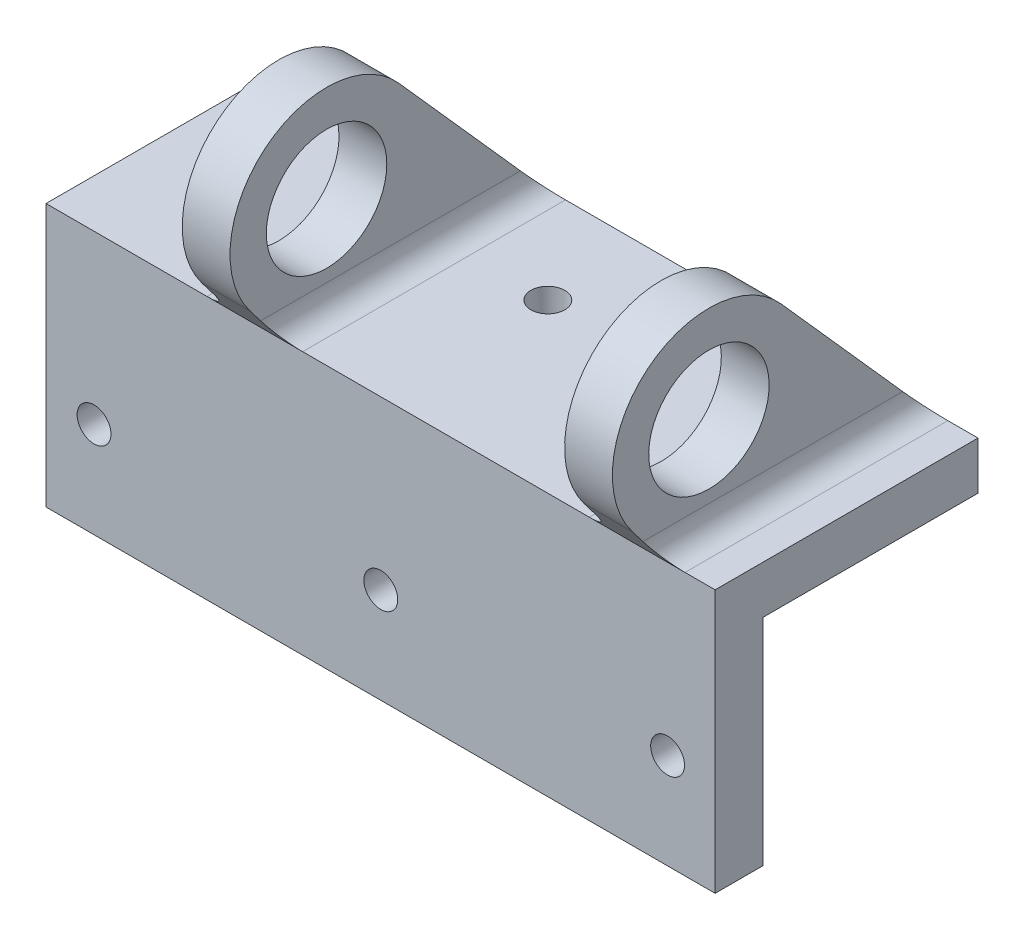
ISO-10303-21;
HEADER;
FILE_DESCRIPTION(('STEP AP214'),'2;1');
FILE_NAME('part.step','',(''),(''),'','','');
FILE_SCHEMA(('AUTOMOTIVE_DESIGN { 1 0 10303 214 1 1 1 1 }'));
ENDSEC;
DATA;
#1=APPLICATION_CONTEXT('core data for automotive mechanical design processes');
#2=APPLICATION_PROTOCOL_DEFINITION('international standard','automotive_design',2000,#1);
#3=PRODUCT_CONTEXT('',#1,'mechanical');
#4=PRODUCT('Part','Part','',(#3));
#5=PRODUCT_RELATED_PRODUCT_CATEGORY('part','',(#4));
#6=PRODUCT_DEFINITION_FORMATION('','',#4);
#7=PRODUCT_DEFINITION_CONTEXT('part definition',#1,'design');
#8=PRODUCT_DEFINITION('design','',#6,#7);
#9=PRODUCT_DEFINITION_SHAPE('','',#8);
#10=(LENGTH_UNIT() NAMED_UNIT(*) SI_UNIT(.MILLI.,.METRE.));
#11=(NAMED_UNIT(*) PLANE_ANGLE_UNIT() SI_UNIT($,.RADIAN.));
#12=(NAMED_UNIT(*) SI_UNIT($,.STERADIAN.) SOLID_ANGLE_UNIT());
#13=UNCERTAINTY_MEASURE_WITH_UNIT(LENGTH_MEASURE(1.E-05),#10,'distance_accuracy_value','');
#14=(GEOMETRIC_REPRESENTATION_CONTEXT(3) GLOBAL_UNCERTAINTY_ASSIGNED_CONTEXT((#13)) GLOBAL_UNIT_ASSIGNED_CONTEXT((#10,
#11,#12)) REPRESENTATION_CONTEXT('',''));
#15=CARTESIAN_POINT('',(0.,0.,0.));
#16=DIRECTION('',(0.,0.,1.));
#17=DIRECTION('',(1.,0.,0.));
#18=AXIS2_PLACEMENT_3D('',#15,#16,#17);
#19=CARTESIAN_POINT('',(0.,20.6375,0.));
#20=DIRECTION('',(0.,1.,0.));
#21=DIRECTION('',(-1.,0.,0.));
#22=AXIS2_PLACEMENT_3D('',#19,#20,#21);
#23=PLANE('',#22);
#24=CARTESIAN_POINT('',(0.,20.6375,-15.875));
#25=DIRECTION('',(0.,1.,0.));
#26=DIRECTION('',(-1.,0.,0.));
#27=AXIS2_PLACEMENT_3D('',#24,#25,#26);
#28=CIRCLE('',#27,2.25);
#29=CARTESIAN_POINT('',(-2.25,20.6375,-15.875));
#30=VERTEX_POINT('',#29);
#31=EDGE_CURVE('E269',#30,#30,#28,.T.);
#32=ORIENTED_EDGE('',*,*,#31,.F.);
#33=EDGE_LOOP('',(#32));
#34=FACE_BOUND('',#33,.T.);
#35=DIRECTION('',(1.,0.,0.));
#36=VECTOR('',#35,1.);
#37=CARTESIAN_POINT('',(0.,20.6375,6.35));
#38=LINE('',#37,#36);
#39=CARTESIAN_POINT('',(-10.35,20.6375,6.35));
#40=VERTEX_POINT('',#39);
#41=CARTESIAN_POINT('',(27.75,20.6375,6.35));
#42=VERTEX_POINT('',#41);
#43=EDGE_CURVE('E259',#40,#42,#38,.T.);
#44=ORIENTED_EDGE('',*,*,#43,.T.);
#45=DIRECTION('',(0.,0.,-1.));
#46=VECTOR('',#45,1.);
#47=CARTESIAN_POINT('',(27.75,20.6375,0.));
#48=LINE('',#47,#46);
#49=CARTESIAN_POINT('',(27.75,20.6375,-28.575));
#50=VERTEX_POINT('',#49);
#51=EDGE_CURVE('E341',#42,#50,#48,.T.);
#52=ORIENTED_EDGE('',*,*,#51,.T.);
#53=DIRECTION('',(1.,0.,0.));
#54=VECTOR('',#53,1.);
#55=CARTESIAN_POINT('',(0.,20.6375,-28.575));
#56=LINE('',#55,#54);
#57=CARTESIAN_POINT('',(-10.35,20.6375,-28.575));
#58=VERTEX_POINT('',#57);
#59=EDGE_CURVE('E266',#58,#50,#56,.T.);
#60=ORIENTED_EDGE('',*,*,#59,.F.);
#61=DIRECTION('',(0.,0.,-1.));
#62=VECTOR('',#61,1.);
#63=CARTESIAN_POINT('',(-10.35,20.6375,6.35));
#64=LINE('',#63,#62);
#65=EDGE_CURVE('E338',#58,#40,#64,.F.);
#66=ORIENTED_EDGE('',*,*,#65,.T.);
#67=EDGE_LOOP('',(#44,#52,#60,#66));
#68=FACE_BOUND('',#67,.T.);
#69=ADVANCED_FACE('F60',(#34,#68),#23,.T.);
#70=CARTESIAN_POINT('',(0.,20.6375,-28.575));
#71=DIRECTION('',(0.,0.,-1.));
#72=DIRECTION('',(-1.,0.,0.));
#73=AXIS2_PLACEMENT_3D('',#70,#71,#72);
#74=PLANE('',#73);
#75=CARTESIAN_POINT('',(-44.45,20.6375,-28.575));
#76=VERTEX_POINT('',#75);
#77=CARTESIAN_POINT('',(-23.05,20.6375,-28.575));
#78=VERTEX_POINT('',#77);
#79=EDGE_CURVE('E263',#76,#78,#56,.T.);
#80=ORIENTED_EDGE('',*,*,#79,.T.);
#81=DIRECTION('',(-1.,0.,0.));
#82=VECTOR('',#81,1.);
#83=CARTESIAN_POINT('',(77.153,20.6375,-28.575));
#84=LINE('',#83,#82);
#85=EDGE_CURVE('E76',#58,#78,#84,.T.);
#86=ORIENTED_EDGE('',*,*,#85,.F.);
#87=ORIENTED_EDGE('',*,*,#59,.T.);
#88=CARTESIAN_POINT('',(40.45,20.6375,-28.575));
#89=VERTEX_POINT('',#88);
#90=EDGE_CURVE('E216',#89,#50,#84,.T.);
#91=ORIENTED_EDGE('',*,*,#90,.F.);
#92=CARTESIAN_POINT('',(44.45,20.6375,-28.575));
#93=VERTEX_POINT('',#92);
#94=EDGE_CURVE('E262',#89,#93,#56,.T.);
#95=ORIENTED_EDGE('',*,*,#94,.T.);
#96=DIRECTION('',(0.,-1.,0.));
#97=VECTOR('',#96,1.);
#98=CARTESIAN_POINT('',(44.45,20.6375,-28.575));
#99=LINE('',#98,#97);
#100=CARTESIAN_POINT('',(44.45,14.2875,-28.575));
#101=VERTEX_POINT('',#100);
#102=EDGE_CURVE('E286',#93,#101,#99,.T.);
#103=ORIENTED_EDGE('',*,*,#102,.T.);
#104=DIRECTION('',(1.,0.,0.));
#105=VECTOR('',#104,1.);
#106=CARTESIAN_POINT('',(0.,14.2875,-28.575));
#107=LINE('',#106,#105);
#108=CARTESIAN_POINT('',(-44.45,14.2875,-28.575));
#109=VERTEX_POINT('',#108);
#110=EDGE_CURVE('E278',#109,#101,#107,.T.);
#111=ORIENTED_EDGE('',*,*,#110,.F.);
#112=DIRECTION('',(0.,-1.,0.));
#113=VECTOR('',#112,1.);
#114=CARTESIAN_POINT('',(-44.45,20.6375,-28.575));
#115=LINE('',#114,#113);
#116=EDGE_CURVE('E272',#76,#109,#115,.T.);
#117=ORIENTED_EDGE('',*,*,#116,.F.);
#118=EDGE_LOOP('',(#80,#86,#87,#91,#95,#103,#111,#117));
#119=FACE_BOUND('',#118,.T.);
#120=ADVANCED_FACE('F398',(#119),#74,.T.);
#121=CARTESIAN_POINT('',(-19.875,52.3875,0.));
#122=DIRECTION('',(1.,0.,0.));
#123=DIRECTION('',(0.,1.,0.));
#124=AXIS2_PLACEMENT_3D('',#121,#122,#123);
#125=PLANE('',#124);
#126=CARTESIAN_POINT('',(-19.875,33.4625,0.));
#127=DIRECTION('',(-1.,0.,0.));
#128=DIRECTION('',(0.,-1.,0.));
#129=AXIS2_PLACEMENT_3D('',#126,#127,#128);
#130=CIRCLE('',#129,8.);
#131=CARTESIAN_POINT('',(-19.875,25.4625,0.));
#132=VERTEX_POINT('',#131);
#133=EDGE_CURVE('E229',#132,#132,#130,.T.);
#134=ORIENTED_EDGE('',*,*,#133,.F.);
#135=EDGE_LOOP('',(#134));
#136=FACE_BOUND('',#135,.T.);
#137=DIRECTION('',(0.,-0.747135927340283,-0.664671276705542));
#138=VECTOR('',#137,1.);
#139=CARTESIAN_POINT('',(-19.875,23.3077369308627,-26.1994887643658));
#140=LINE('',#139,#138);
#141=CARTESIAN_POINT('',(-19.875,41.9869091237486,-9.58201826813913));
#142=VERTEX_POINT('',#141);
#143=CARTESIAN_POINT('',(-19.875,23.8125,-25.7504385964912));
#144=VERTEX_POINT('',#143);
#145=EDGE_CURVE('E191',#142,#144,#140,.T.);
#146=ORIENTED_EDGE('',*,*,#145,.T.);
#147=DIRECTION('',(0.,0.,-1.));
#148=VECTOR('',#147,1.);
#149=CARTESIAN_POINT('',(-19.875,23.8125,0.));
#150=LINE('',#149,#148);
#151=CARTESIAN_POINT('',(-19.875,23.8125,8.77023635477583));
#152=VERTEX_POINT('',#151);
#153=EDGE_CURVE('E348',#144,#152,#150,.F.);
#154=ORIENTED_EDGE('',*,*,#153,.T.);
#155=DIRECTION('',(0.,0.795288157834506,0.606231594366541));
#156=VECTOR('',#155,1.);
#157=CARTESIAN_POINT('',(-19.875,4.52310891554845,-5.93366461028824));
#158=LINE('',#157,#156);
#159=CARTESIAN_POINT('',(-19.875,25.6875798022491,10.1995706242275));
#160=VERTEX_POINT('',#159);
#161=EDGE_CURVE('E236',#152,#160,#158,.T.);
#162=ORIENTED_EDGE('',*,*,#161,.T.);
#163=CARTESIAN_POINT('',(-19.875,33.4625,0.));
#164=DIRECTION('',(-1.,0.,0.));
#165=DIRECTION('',(0.,-1.,0.));
#166=AXIS2_PLACEMENT_3D('',#163,#164,#165);
#167=CIRCLE('',#166,12.825);
#168=EDGE_CURVE('E233',#160,#142,#167,.T.);
#169=ORIENTED_EDGE('',*,*,#168,.T.);
#170=EDGE_LOOP('',(#146,#154,#162,#169));
#171=FACE_BOUND('',#170,.T.);
#172=ADVANCED_FACE('F429',(#136,#171),#125,.F.);
#173=CARTESIAN_POINT('',(-13.525,52.3875,0.));
#174=DIRECTION('',(1.,0.,0.));
#175=DIRECTION('',(0.,1.,0.));
#176=AXIS2_PLACEMENT_3D('',#173,#174,#175);
#177=PLANE('',#176);
#178=CARTESIAN_POINT('',(-13.525,33.4625,0.));
#179=DIRECTION('',(1.,0.,0.));
#180=DIRECTION('',(0.,1.,0.));
#181=AXIS2_PLACEMENT_3D('',#178,#179,#180);
#182=CIRCLE('',#181,8.);
#183=CARTESIAN_POINT('',(-13.525,41.4625,0.));
#184=VERTEX_POINT('',#183);
#185=EDGE_CURVE('E235',#184,#184,#182,.F.);
#186=ORIENTED_EDGE('',*,*,#185,.T.);
#187=EDGE_LOOP('',(#186));
#188=FACE_BOUND('',#187,.T.);
#189=DIRECTION('',(0.,0.795288157834506,0.606231594366541));
#190=VECTOR('',#189,1.);
#191=CARTESIAN_POINT('',(-13.525,4.52310891554845,-5.93366461028824));
#192=LINE('',#191,#190);
#193=CARTESIAN_POINT('',(-13.525,23.8125,8.77023635477583));
#194=VERTEX_POINT('',#193);
#195=CARTESIAN_POINT('',(-13.525,25.6875798022491,10.1995706242275));
#196=VERTEX_POINT('',#195);
#197=EDGE_CURVE('E239',#194,#196,#192,.T.);
#198=ORIENTED_EDGE('',*,*,#197,.F.);
#199=DIRECTION('',(0.,0.,-1.));
#200=VECTOR('',#199,1.);
#201=CARTESIAN_POINT('',(-13.525,23.8125,-28.575));
#202=LINE('',#201,#200);
#203=CARTESIAN_POINT('',(-13.525,23.8125,-25.7504385964912));
#204=VERTEX_POINT('',#203);
#205=EDGE_CURVE('E350',#194,#204,#202,.T.);
#206=ORIENTED_EDGE('',*,*,#205,.T.);
#207=DIRECTION('',(0.,0.747135927340283,0.664671276705542));
#208=VECTOR('',#207,1.);
#209=CARTESIAN_POINT('',(-13.525,52.5510730012343,-0.18386722918243));
#210=LINE('',#209,#208);
#211=CARTESIAN_POINT('',(-13.525,41.9869091237486,-9.58201826813913));
#212=VERTEX_POINT('',#211);
#213=EDGE_CURVE('E227',#204,#212,#210,.T.);
#214=ORIENTED_EDGE('',*,*,#213,.T.);
#215=CARTESIAN_POINT('',(-13.525,33.4625,0.));
#216=DIRECTION('',(1.,0.,0.));
#217=DIRECTION('',(0.,1.,0.));
#218=AXIS2_PLACEMENT_3D('',#215,#216,#217);
#219=CIRCLE('',#218,12.825);
#220=EDGE_CURVE('E232',#196,#212,#219,.F.);
#221=ORIENTED_EDGE('',*,*,#220,.F.);
#222=EDGE_LOOP('',(#198,#206,#214,#221));
#223=FACE_BOUND('',#222,.T.);
#224=ADVANCED_FACE('F488',(#188,#223),#177,.T.);
#225=CARTESIAN_POINT('',(37.275,52.3875,0.));
#226=DIRECTION('',(1.,0.,0.));
#227=DIRECTION('',(0.,1.,0.));
#228=AXIS2_PLACEMENT_3D('',#225,#226,#227);
#229=PLANE('',#228);
#230=CARTESIAN_POINT('',(37.275,33.4625,0.));
#231=DIRECTION('',(1.,0.,0.));
#232=DIRECTION('',(0.,1.,0.));
#233=AXIS2_PLACEMENT_3D('',#230,#231,#232);
#234=CIRCLE('',#233,8.);
#235=CARTESIAN_POINT('',(37.275,25.4625,0.));
#236=VERTEX_POINT('',#235);
#237=EDGE_CURVE('E222',#236,#236,#234,.T.);
#238=ORIENTED_EDGE('',*,*,#237,.F.);
#239=EDGE_LOOP('',(#238));
#240=FACE_BOUND('',#239,.T.);
#241=DIRECTION('',(0.,-0.795288157834505,-0.606231594366542));
#242=VECTOR('',#241,1.);
#243=CARTESIAN_POINT('',(37.275,4.52310891554847,-5.93366461028824));
#244=LINE('',#243,#242);
#245=CARTESIAN_POINT('',(37.275,25.6875798022491,10.1995706242275));
#246=VERTEX_POINT('',#245);
#247=CARTESIAN_POINT('',(37.275,23.8125,8.77023635477584));
#248=VERTEX_POINT('',#247);
#249=EDGE_CURVE('E192',#246,#248,#244,.T.);
#250=ORIENTED_EDGE('',*,*,#249,.T.);
#251=DIRECTION('',(0.,0.,-1.));
#252=VECTOR('',#251,1.);
#253=CARTESIAN_POINT('',(37.275,23.8125,-28.575));
#254=LINE('',#253,#252);
#255=CARTESIAN_POINT('',(37.275,23.8125,-25.7504385964912));
#256=VERTEX_POINT('',#255);
#257=EDGE_CURVE('E332',#248,#256,#254,.T.);
#258=ORIENTED_EDGE('',*,*,#257,.T.);
#259=DIRECTION('',(0.,0.747135927340283,0.664671276705542));
#260=VECTOR('',#259,1.);
#261=CARTESIAN_POINT('',(37.275,52.5510730012343,-0.18386722918243));
#262=LINE('',#261,#260);
#263=CARTESIAN_POINT('',(37.275,41.9869091237486,-9.58201826813913));
#264=VERTEX_POINT('',#263);
#265=EDGE_CURVE('E225',#256,#264,#262,.T.);
#266=ORIENTED_EDGE('',*,*,#265,.T.);
#267=CARTESIAN_POINT('',(37.275,33.4625,0.));
#268=DIRECTION('',(1.,0.,0.));
#269=DIRECTION('',(0.,1.,0.));
#270=AXIS2_PLACEMENT_3D('',#267,#268,#269);
#271=CIRCLE('',#270,12.825);
#272=EDGE_CURVE('E203',#264,#246,#271,.T.);
#273=ORIENTED_EDGE('',*,*,#272,.T.);
#274=EDGE_LOOP('',(#250,#258,#266,#273));
#275=FACE_BOUND('',#274,.T.);
#276=ADVANCED_FACE('F407',(#240,#275),#229,.T.);
#277=CARTESIAN_POINT('',(30.925,52.3875,0.));
#278=DIRECTION('',(1.,0.,0.));
#279=DIRECTION('',(0.,1.,0.));
#280=AXIS2_PLACEMENT_3D('',#277,#278,#279);
#281=PLANE('',#280);
#282=CARTESIAN_POINT('',(30.925,33.4625,0.));
#283=DIRECTION('',(1.,0.,0.));
#284=DIRECTION('',(0.,1.,0.));
#285=AXIS2_PLACEMENT_3D('',#282,#283,#284);
#286=CIRCLE('',#285,8.);
#287=CARTESIAN_POINT('',(30.925,25.4625,0.));
#288=VERTEX_POINT('',#287);
#289=EDGE_CURVE('E219',#288,#288,#286,.T.);
#290=ORIENTED_EDGE('',*,*,#289,.T.);
#291=EDGE_LOOP('',(#290));
#292=FACE_BOUND('',#291,.T.);
#293=DIRECTION('',(0.,0.747135927340283,0.664671276705542));
#294=VECTOR('',#293,1.);
#295=CARTESIAN_POINT('',(30.925,52.5510730012343,-0.18386722918243));
#296=LINE('',#295,#294);
#297=CARTESIAN_POINT('',(30.925,23.8125,-25.7504385964912));
#298=VERTEX_POINT('',#297);
#299=CARTESIAN_POINT('',(30.925,41.9869091237486,-9.58201826813913));
#300=VERTEX_POINT('',#299);
#301=EDGE_CURVE('E330',#298,#300,#296,.T.);
#302=ORIENTED_EDGE('',*,*,#301,.F.);
#303=DIRECTION('',(0.,0.,-1.));
#304=VECTOR('',#303,1.);
#305=CARTESIAN_POINT('',(30.925,23.8125,0.));
#306=LINE('',#305,#304);
#307=CARTESIAN_POINT('',(30.925,23.8125,8.77023635477583));
#308=VERTEX_POINT('',#307);
#309=EDGE_CURVE('E186',#298,#308,#306,.F.);
#310=ORIENTED_EDGE('',*,*,#309,.T.);
#311=DIRECTION('',(0.,0.795288157834505,0.606231594366542));
#312=VECTOR('',#311,1.);
#313=CARTESIAN_POINT('',(30.925,4.52310891554847,-5.93366461028824));
#314=LINE('',#313,#312);
#315=CARTESIAN_POINT('',(30.925,25.6875798022491,10.1995706242275));
#316=VERTEX_POINT('',#315);
#317=EDGE_CURVE('E180',#308,#316,#314,.T.);
#318=ORIENTED_EDGE('',*,*,#317,.T.);
#319=CARTESIAN_POINT('',(30.925,33.4625,0.));
#320=DIRECTION('',(1.,0.,0.));
#321=DIRECTION('',(0.,1.,0.));
#322=AXIS2_PLACEMENT_3D('',#319,#320,#321);
#323=CIRCLE('',#322,12.825);
#324=EDGE_CURVE('E184',#300,#316,#323,.T.);
#325=ORIENTED_EDGE('',*,*,#324,.F.);
#326=EDGE_LOOP('',(#302,#310,#318,#325));
#327=FACE_BOUND('',#326,.T.);
#328=ADVANCED_FACE('F183',(#292,#327),#281,.F.);
#329=CARTESIAN_POINT('',(-44.45,20.6375,6.35));
#330=VERTEX_POINT('',#329);
#331=CARTESIAN_POINT('',(-23.05,20.6375,6.35));
#332=VERTEX_POINT('',#331);
#333=EDGE_CURVE('E255',#330,#332,#38,.T.);
#334=ORIENTED_EDGE('',*,*,#333,.T.);
#335=DIRECTION('',(0.,0.,-1.));
#336=VECTOR('',#335,1.);
#337=CARTESIAN_POINT('',(-23.05,20.6375,0.));
#338=LINE('',#337,#336);
#339=EDGE_CURVE('E345',#332,#78,#338,.T.);
#340=ORIENTED_EDGE('',*,*,#339,.T.);
#341=ORIENTED_EDGE('',*,*,#79,.F.);
#342=DIRECTION('',(0.,0.,-1.));
#343=VECTOR('',#342,1.);
#344=CARTESIAN_POINT('',(-44.45,20.6375,0.));
#345=LINE('',#344,#343);
#346=EDGE_CURVE('E265',#330,#76,#345,.T.);
#347=ORIENTED_EDGE('',*,*,#346,.F.);
#348=EDGE_LOOP('',(#334,#340,#341,#347));
#349=FACE_BOUND('',#348,.T.);
#350=CARTESIAN_POINT('',(-38.1,20.6375,-15.875));
#351=DIRECTION('',(0.,1.,0.));
#352=DIRECTION('',(-1.,0.,0.));
#353=AXIS2_PLACEMENT_3D('',#350,#351,#352);
#354=CIRCLE('',#353,2.25);
#355=CARTESIAN_POINT('',(-40.35,20.6375,-15.875));
#356=VERTEX_POINT('',#355);
#357=EDGE_CURVE('E250',#356,#356,#354,.T.);
#358=ORIENTED_EDGE('',*,*,#357,.F.);
#359=EDGE_LOOP('',(#358));
#360=FACE_BOUND('',#359,.T.);
#361=ADVANCED_FACE('F424',(#349,#360),#23,.T.);
#362=ORIENTED_EDGE('',*,*,#94,.F.);
#363=DIRECTION('',(0.,0.,-1.));
#364=VECTOR('',#363,1.);
#365=CARTESIAN_POINT('',(40.45,20.6375,6.34999999999999));
#366=LINE('',#365,#364);
#367=CARTESIAN_POINT('',(40.45,20.6375,6.34999999999999));
#368=VERTEX_POINT('',#367);
#369=EDGE_CURVE('E335',#89,#368,#366,.F.);
#370=ORIENTED_EDGE('',*,*,#369,.T.);
#371=CARTESIAN_POINT('',(44.45,20.6375,6.35));
#372=VERTEX_POINT('',#371);
#373=EDGE_CURVE('E253',#368,#372,#38,.T.);
#374=ORIENTED_EDGE('',*,*,#373,.T.);
#375=DIRECTION('',(0.,0.,-1.));
#376=VECTOR('',#375,1.);
#377=CARTESIAN_POINT('',(44.45,20.6375,0.));
#378=LINE('',#377,#376);
#379=EDGE_CURVE('E258',#372,#93,#378,.T.);
#380=ORIENTED_EDGE('',*,*,#379,.T.);
#381=EDGE_LOOP('',(#362,#370,#374,#380));
#382=FACE_BOUND('',#381,.T.);
#383=ADVANCED_FACE('F387',(#382),#23,.T.);
#384=CARTESIAN_POINT('',(0.,0.,6.35));
#385=DIRECTION('',(0.,0.,1.));
#386=DIRECTION('',(1.,0.,0.));
#387=AXIS2_PLACEMENT_3D('',#384,#385,#386);
#388=PLANE('',#387);
#389=CARTESIAN_POINT('',(0.0330872837052895,-1.58750000000001,6.35));
#390=DIRECTION('',(0.,0.,1.));
#391=DIRECTION('',(1.,0.,0.));
#392=AXIS2_PLACEMENT_3D('',#389,#390,#391);
#393=CIRCLE('',#392,2.25);
#394=CARTESIAN_POINT('',(2.28308728370529,-1.58750000000001,6.35));
#395=VERTEX_POINT('',#394);
#396=EDGE_CURVE('E296',#395,#395,#393,.T.);
#397=ORIENTED_EDGE('',*,*,#396,.F.);
#398=EDGE_LOOP('',(#397));
#399=FACE_BOUND('',#398,.T.);
#400=DIRECTION('',(0.,-1.,0.));
#401=VECTOR('',#400,1.);
#402=CARTESIAN_POINT('',(-44.45,-14.2875,6.35));
#403=LINE('',#402,#401);
#404=CARTESIAN_POINT('',(-44.45,-14.2875,6.35));
#405=VERTEX_POINT('',#404);
#406=EDGE_CURVE('E308',#330,#405,#403,.T.);
#407=ORIENTED_EDGE('',*,*,#406,.T.);
#408=DIRECTION('',(1.,0.,0.));
#409=VECTOR('',#408,1.);
#410=CARTESIAN_POINT('',(44.45,-14.2875,6.35));
#411=LINE('',#410,#409);
#412=CARTESIAN_POINT('',(44.45,-14.2875,6.35));
#413=VERTEX_POINT('',#412);
#414=EDGE_CURVE('E311',#405,#413,#411,.T.);
#415=ORIENTED_EDGE('',*,*,#414,.T.);
#416=DIRECTION('',(0.,1.,0.));
#417=VECTOR('',#416,1.);
#418=CARTESIAN_POINT('',(44.45,-14.2875,6.35));
#419=LINE('',#418,#417);
#420=EDGE_CURVE('E314',#413,#372,#419,.T.);
#421=ORIENTED_EDGE('',*,*,#420,.T.);
#422=ORIENTED_EDGE('',*,*,#373,.F.);
#423=DIRECTION('',(1.,0.,0.));
#424=VECTOR('',#423,1.);
#425=CARTESIAN_POINT('',(-17.7769763459349,20.6375,6.34999999999999));
#426=LINE('',#425,#424);
#427=EDGE_CURVE('E207',#42,#368,#426,.T.);
#428=ORIENTED_EDGE('',*,*,#427,.F.);
#429=ORIENTED_EDGE('',*,*,#43,.F.);
#430=DIRECTION('',(-1.,0.,0.));
#431=VECTOR('',#430,1.);
#432=CARTESIAN_POINT('',(15.1525718114348,20.6375,6.35));
#433=LINE('',#432,#431);
#434=EDGE_CURVE('E238',#40,#332,#433,.T.);
#435=ORIENTED_EDGE('',*,*,#434,.T.);
#436=ORIENTED_EDGE('',*,*,#333,.F.);
#437=EDGE_LOOP('',(#407,#415,#421,#422,#428,#429,#435,#436));
#438=FACE_BOUND('',#437,.T.);
#439=CARTESIAN_POINT('',(-38.0669127162947,-1.58750000000001,6.35));
#440=DIRECTION('',(0.,0.,1.));
#441=DIRECTION('',(1.,0.,0.));
#442=AXIS2_PLACEMENT_3D('',#439,#440,#441);
#443=CIRCLE('',#442,2.25);
#444=CARTESIAN_POINT('',(-35.8169127162947,-1.58750000000001,6.35));
#445=VERTEX_POINT('',#444);
#446=EDGE_CURVE('E302',#445,#445,#443,.T.);
#447=ORIENTED_EDGE('',*,*,#446,.F.);
#448=EDGE_LOOP('',(#447));
#449=FACE_BOUND('',#448,.T.);
#450=CARTESIAN_POINT('',(38.1330872837053,-1.58750000000001,6.35));
#451=DIRECTION('',(0.,0.,1.));
#452=DIRECTION('',(1.,0.,0.));
#453=AXIS2_PLACEMENT_3D('',#450,#451,#452);
#454=CIRCLE('',#453,2.25);
#455=CARTESIAN_POINT('',(40.3830872837053,-1.58750000000001,6.35));
#456=VERTEX_POINT('',#455);
#457=EDGE_CURVE('E290',#456,#456,#454,.T.);
#458=ORIENTED_EDGE('',*,*,#457,.F.);
#459=EDGE_LOOP('',(#458));
#460=FACE_BOUND('',#459,.T.);
#461=ADVANCED_FACE('F381',(#399,#438,#449,#460),#388,.T.);
#462=CARTESIAN_POINT('',(0.,0.,0.));
#463=DIRECTION('',(0.,0.,1.));
#464=DIRECTION('',(1.,0.,0.));
#465=AXIS2_PLACEMENT_3D('',#462,#463,#464);
#466=PLANE('',#465);
#467=DIRECTION('',(0.,-1.,0.));
#468=VECTOR('',#467,1.);
#469=CARTESIAN_POINT('',(-44.45,-14.2875,0.));
#470=LINE('',#469,#468);
#471=CARTESIAN_POINT('',(-44.45,14.2875,0.));
#472=VERTEX_POINT('',#471);
#473=CARTESIAN_POINT('',(-44.45,-14.2875,0.));
#474=VERTEX_POINT('',#473);
#475=EDGE_CURVE('E305',#472,#474,#470,.T.);
#476=ORIENTED_EDGE('',*,*,#475,.F.);
#477=DIRECTION('',(-1.,0.,0.));
#478=VECTOR('',#477,1.);
#479=CARTESIAN_POINT('',(44.45,14.2875,0.));
#480=LINE('',#479,#478);
#481=CARTESIAN_POINT('',(44.45,14.2875,0.));
#482=VERTEX_POINT('',#481);
#483=EDGE_CURVE('E312',#482,#472,#480,.T.);
#484=ORIENTED_EDGE('',*,*,#483,.F.);
#485=DIRECTION('',(0.,1.,0.));
#486=VECTOR('',#485,1.);
#487=CARTESIAN_POINT('',(44.45,-14.2875,0.));
#488=LINE('',#487,#486);
#489=CARTESIAN_POINT('',(44.45,-14.2875,0.));
#490=VERTEX_POINT('',#489);
#491=EDGE_CURVE('E322',#490,#482,#488,.T.);
#492=ORIENTED_EDGE('',*,*,#491,.F.);
#493=DIRECTION('',(1.,0.,0.));
#494=VECTOR('',#493,1.);
#495=CARTESIAN_POINT('',(44.45,-14.2875,0.));
#496=LINE('',#495,#494);
#497=EDGE_CURVE('E320',#474,#490,#496,.T.);
#498=ORIENTED_EDGE('',*,*,#497,.F.);
#499=EDGE_LOOP('',(#476,#484,#492,#498));
#500=FACE_BOUND('',#499,.T.);
#501=CARTESIAN_POINT('',(-38.0669127162947,-1.58750000000001,0.));
#502=DIRECTION('',(0.,0.,1.));
#503=DIRECTION('',(1.,0.,0.));
#504=AXIS2_PLACEMENT_3D('',#501,#502,#503);
#505=CIRCLE('',#504,2.25);
#506=CARTESIAN_POINT('',(-35.8169127162947,-1.58750000000001,0.));
#507=VERTEX_POINT('',#506);
#508=EDGE_CURVE('E299',#507,#507,#505,.T.);
#509=ORIENTED_EDGE('',*,*,#508,.T.);
#510=EDGE_LOOP('',(#509));
#511=FACE_BOUND('',#510,.T.);
#512=CARTESIAN_POINT('',(0.0330872837052895,-1.58750000000001,0.));
#513=DIRECTION('',(0.,0.,1.));
#514=DIRECTION('',(1.,0.,0.));
#515=AXIS2_PLACEMENT_3D('',#512,#513,#514);
#516=CIRCLE('',#515,2.25);
#517=CARTESIAN_POINT('',(2.28308728370529,-1.58750000000001,0.));
#518=VERTEX_POINT('',#517);
#519=EDGE_CURVE('E293',#518,#518,#516,.T.);
#520=ORIENTED_EDGE('',*,*,#519,.T.);
#521=EDGE_LOOP('',(#520));
#522=FACE_BOUND('',#521,.T.);
#523=CARTESIAN_POINT('',(38.1330872837053,-1.58750000000001,0.));
#524=DIRECTION('',(0.,0.,1.));
#525=DIRECTION('',(1.,0.,0.));
#526=AXIS2_PLACEMENT_3D('',#523,#524,#525);
#527=CIRCLE('',#526,2.25);
#528=CARTESIAN_POINT('',(40.3830872837053,-1.58750000000001,0.));
#529=VERTEX_POINT('',#528);
#530=EDGE_CURVE('E289',#529,#529,#527,.T.);
#531=ORIENTED_EDGE('',*,*,#530,.T.);
#532=EDGE_LOOP('',(#531));
#533=FACE_BOUND('',#532,.T.);
#534=ADVANCED_FACE('F440',(#500,#511,#522,#533),#466,.F.);
#535=CARTESIAN_POINT('',(-44.45,-14.2875,6.35));
#536=DIRECTION('',(1.,0.,0.));
#537=DIRECTION('',(0.,0.,-1.));
#538=AXIS2_PLACEMENT_3D('',#535,#536,#537);
#539=PLANE('',#538);
#540=ORIENTED_EDGE('',*,*,#475,.T.);
#541=DIRECTION('',(0.,0.,-1.));
#542=VECTOR('',#541,1.);
#543=CARTESIAN_POINT('',(-44.45,-14.2875,6.35));
#544=LINE('',#543,#542);
#545=EDGE_CURVE('E327',#405,#474,#544,.T.);
#546=ORIENTED_EDGE('',*,*,#545,.F.);
#547=ORIENTED_EDGE('',*,*,#406,.F.);
#548=ORIENTED_EDGE('',*,*,#346,.T.);
#549=ORIENTED_EDGE('',*,*,#116,.T.);
#550=DIRECTION('',(0.,0.,-1.));
#551=VECTOR('',#550,1.);
#552=CARTESIAN_POINT('',(-44.45,14.2875,0.));
#553=LINE('',#552,#551);
#554=EDGE_CURVE('E280',#472,#109,#553,.T.);
#555=ORIENTED_EDGE('',*,*,#554,.F.);
#556=EDGE_LOOP('',(#540,#546,#547,#548,#549,#555));
#557=FACE_BOUND('',#556,.T.);
#558=ADVANCED_FACE('F447',(#557),#539,.F.);
#559=CARTESIAN_POINT('',(44.45,-14.2875,6.35));
#560=DIRECTION('',(0.,1.,0.));
#561=DIRECTION('',(-1.,0.,0.));
#562=AXIS2_PLACEMENT_3D('',#559,#560,#561);
#563=PLANE('',#562);
#564=ORIENTED_EDGE('',*,*,#497,.T.);
#565=DIRECTION('',(0.,0.,-1.));
#566=VECTOR('',#565,1.);
#567=CARTESIAN_POINT('',(44.45,-14.2875,6.35));
#568=LINE('',#567,#566);
#569=EDGE_CURVE('E317',#413,#490,#568,.T.);
#570=ORIENTED_EDGE('',*,*,#569,.F.);
#571=ORIENTED_EDGE('',*,*,#414,.F.);
#572=ORIENTED_EDGE('',*,*,#545,.T.);
#573=EDGE_LOOP('',(#564,#570,#571,#572));
#574=FACE_BOUND('',#573,.T.);
#575=ADVANCED_FACE('F457',(#574),#563,.F.);
#576=CARTESIAN_POINT('',(44.45,-14.2875,6.35));
#577=DIRECTION('',(-1.,0.,0.));
#578=DIRECTION('',(0.,0.,1.));
#579=AXIS2_PLACEMENT_3D('',#576,#577,#578);
#580=PLANE('',#579);
#581=ORIENTED_EDGE('',*,*,#491,.T.);
#582=DIRECTION('',(0.,0.,-1.));
#583=VECTOR('',#582,1.);
#584=CARTESIAN_POINT('',(44.45,14.2875,0.));
#585=LINE('',#584,#583);
#586=EDGE_CURVE('E275',#482,#101,#585,.T.);
#587=ORIENTED_EDGE('',*,*,#586,.T.);
#588=ORIENTED_EDGE('',*,*,#102,.F.);
#589=ORIENTED_EDGE('',*,*,#379,.F.);
#590=ORIENTED_EDGE('',*,*,#420,.F.);
#591=ORIENTED_EDGE('',*,*,#569,.T.);
#592=EDGE_LOOP('',(#581,#587,#588,#589,#590,#591));
#593=FACE_BOUND('',#592,.T.);
#594=ADVANCED_FACE('F395',(#593),#580,.F.);
#595=CARTESIAN_POINT('',(-38.0669127162947,-1.58750000000001,6.35));
#596=DIRECTION('',(0.,0.,-1.));
#597=DIRECTION('',(-1.,0.,0.));
#598=AXIS2_PLACEMENT_3D('',#595,#596,#597);
#599=CYLINDRICAL_SURFACE('',#598,2.25);
#600=ORIENTED_EDGE('',*,*,#446,.T.);
#601=EDGE_LOOP('',(#600));
#602=FACE_BOUND('',#601,.T.);
#603=ORIENTED_EDGE('',*,*,#508,.F.);
#604=EDGE_LOOP('',(#603));
#605=FACE_BOUND('',#604,.T.);
#606=ADVANCED_FACE('F452',(#602,#605),#599,.F.);
#607=CARTESIAN_POINT('',(0.0330872837052895,-1.58750000000001,6.35));
#608=DIRECTION('',(0.,0.,-1.));
#609=DIRECTION('',(-1.,0.,0.));
#610=AXIS2_PLACEMENT_3D('',#607,#608,#609);
#611=CYLINDRICAL_SURFACE('',#610,2.25);
#612=ORIENTED_EDGE('',*,*,#396,.T.);
#613=EDGE_LOOP('',(#612));
#614=FACE_BOUND('',#613,.T.);
#615=ORIENTED_EDGE('',*,*,#519,.F.);
#616=EDGE_LOOP('',(#615));
#617=FACE_BOUND('',#616,.T.);
#618=ADVANCED_FACE('F823',(#614,#617),#611,.F.);
#619=CARTESIAN_POINT('',(38.1330872837053,-1.58750000000001,6.35));
#620=DIRECTION('',(0.,0.,-1.));
#621=DIRECTION('',(-1.,0.,0.));
#622=AXIS2_PLACEMENT_3D('',#619,#620,#621);
#623=CYLINDRICAL_SURFACE('',#622,2.25);
#624=ORIENTED_EDGE('',*,*,#457,.T.);
#625=EDGE_LOOP('',(#624));
#626=FACE_BOUND('',#625,.T.);
#627=ORIENTED_EDGE('',*,*,#530,.F.);
#628=EDGE_LOOP('',(#627));
#629=FACE_BOUND('',#628,.T.);
#630=ADVANCED_FACE('F698',(#626,#629),#623,.F.);
#631=CARTESIAN_POINT('',(0.,14.2875,0.));
#632=DIRECTION('',(0.,1.,0.));
#633=DIRECTION('',(-1.,0.,0.));
#634=AXIS2_PLACEMENT_3D('',#631,#632,#633);
#635=PLANE('',#634);
#636=ORIENTED_EDGE('',*,*,#483,.T.);
#637=ORIENTED_EDGE('',*,*,#554,.T.);
#638=ORIENTED_EDGE('',*,*,#110,.T.);
#639=ORIENTED_EDGE('',*,*,#586,.F.);
#640=EDGE_LOOP('',(#636,#637,#638,#639));
#641=FACE_BOUND('',#640,.T.);
#642=CARTESIAN_POINT('',(-38.1,14.2875,-15.875));
#643=DIRECTION('',(0.,1.,0.));
#644=DIRECTION('',(-1.,0.,0.));
#645=AXIS2_PLACEMENT_3D('',#642,#643,#644);
#646=CIRCLE('',#645,2.25);
#647=CARTESIAN_POINT('',(-40.35,14.2875,-15.875));
#648=VERTEX_POINT('',#647);
#649=EDGE_CURVE('E246',#648,#648,#646,.T.);
#650=ORIENTED_EDGE('',*,*,#649,.T.);
#651=EDGE_LOOP('',(#650));
#652=FACE_BOUND('',#651,.T.);
#653=CARTESIAN_POINT('',(0.,14.2875,-15.875));
#654=DIRECTION('',(0.,1.,0.));
#655=DIRECTION('',(-1.,0.,0.));
#656=AXIS2_PLACEMENT_3D('',#653,#654,#655);
#657=CIRCLE('',#656,2.25);
#658=CARTESIAN_POINT('',(-2.25,14.2875,-15.875));
#659=VERTEX_POINT('',#658);
#660=EDGE_CURVE('E254',#659,#659,#657,.T.);
#661=ORIENTED_EDGE('',*,*,#660,.T.);
#662=EDGE_LOOP('',(#661));
#663=FACE_BOUND('',#662,.T.);
#664=ADVANCED_FACE('F694',(#641,#652,#663),#635,.F.);
#665=CARTESIAN_POINT('',(-38.1,20.6375,-15.875));
#666=DIRECTION('',(0.,-1.,0.));
#667=DIRECTION('',(1.,0.,0.));
#668=AXIS2_PLACEMENT_3D('',#665,#666,#667);
#669=CYLINDRICAL_SURFACE('',#668,2.25);
#670=ORIENTED_EDGE('',*,*,#357,.T.);
#671=EDGE_LOOP('',(#670));
#672=FACE_BOUND('',#671,.T.);
#673=ORIENTED_EDGE('',*,*,#649,.F.);
#674=EDGE_LOOP('',(#673));
#675=FACE_BOUND('',#674,.T.);
#676=ADVANCED_FACE('F697',(#672,#675),#669,.F.);
#677=CARTESIAN_POINT('',(0.,20.6375,-15.875));
#678=DIRECTION('',(0.,-1.,0.));
#679=DIRECTION('',(1.,0.,0.));
#680=AXIS2_PLACEMENT_3D('',#677,#678,#679);
#681=CYLINDRICAL_SURFACE('',#680,2.25);
#682=ORIENTED_EDGE('',*,*,#31,.T.);
#683=EDGE_LOOP('',(#682));
#684=FACE_BOUND('',#683,.T.);
#685=ORIENTED_EDGE('',*,*,#660,.F.);
#686=EDGE_LOOP('',(#685));
#687=FACE_BOUND('',#686,.T.);
#688=ADVANCED_FACE('F503',(#684,#687),#681,.F.);
#689=CARTESIAN_POINT('',(15.1525718114348,33.4625,0.));
#690=DIRECTION('',(-1.,0.,0.));
#691=DIRECTION('',(0.,-1.,0.));
#692=AXIS2_PLACEMENT_3D('',#689,#690,#691);
#693=CYLINDRICAL_SURFACE('',#692,8.);
#694=ORIENTED_EDGE('',*,*,#133,.T.);
#695=EDGE_LOOP('',(#694));
#696=FACE_BOUND('',#695,.T.);
#697=ORIENTED_EDGE('',*,*,#185,.F.);
#698=EDGE_LOOP('',(#697));
#699=FACE_BOUND('',#698,.T.);
#700=ADVANCED_FACE('F497',(#696,#699),#693,.F.);
#701=CARTESIAN_POINT('',(15.1525718114348,33.4625,0.));
#702=DIRECTION('',(-1.,0.,0.));
#703=DIRECTION('',(0.,-1.,0.));
#704=AXIS2_PLACEMENT_3D('',#701,#702,#703);
#705=CYLINDRICAL_SURFACE('',#704,12.825);
#706=DIRECTION('',(-1.,0.,0.));
#707=VECTOR('',#706,1.);
#708=CARTESIAN_POINT('',(15.1525718114348,25.6875798022491,10.1995706242275));
#709=LINE('',#708,#707);
#710=EDGE_CURVE('E241',#196,#160,#709,.T.);
#711=ORIENTED_EDGE('',*,*,#710,.F.);
#712=ORIENTED_EDGE('',*,*,#220,.T.);
#713=DIRECTION('',(-1.,0.,0.));
#714=VECTOR('',#713,1.);
#715=CARTESIAN_POINT('',(77.153,41.9869091237486,-9.58201826813913));
#716=LINE('',#715,#714);
#717=EDGE_CURVE('E213',#212,#142,#716,.T.);
#718=ORIENTED_EDGE('',*,*,#717,.T.);
#719=ORIENTED_EDGE('',*,*,#168,.F.);
#720=EDGE_LOOP('',(#711,#712,#718,#719));
#721=FACE_BOUND('',#720,.T.);
#722=ADVANCED_FACE('F484',(#721),#705,.T.);
#723=CARTESIAN_POINT('',(15.1525718114348,4.52310891554846,-5.93366461028824));
#724=DIRECTION('',(0.,-0.606231594366541,0.795288157834505));
#725=DIRECTION('',(0.,-0.795288157834505,-0.606231594366541));
#726=AXIS2_PLACEMENT_3D('',#723,#724,#725);
#727=PLANE('',#726);
#728=ORIENTED_EDGE('',*,*,#434,.F.);
#729=CARTESIAN_POINT('',(-10.35,23.8125,8.77023635477583));
#730=DIRECTION('',(0.,-0.606231594366541,0.795288157834505));
#731=DIRECTION('',(0.,0.795288157834505,0.606231594366541));
#732=AXIS2_PLACEMENT_3D('',#729,#730,#731);
#733=ELLIPSE('',#732,3.99226364522417,3.175);
#734=EDGE_CURVE('E12',#40,#194,#733,.F.);
#735=ORIENTED_EDGE('',*,*,#734,.T.);
#736=ORIENTED_EDGE('',*,*,#197,.T.);
#737=ORIENTED_EDGE('',*,*,#710,.T.);
#738=ORIENTED_EDGE('',*,*,#161,.F.);
#739=CARTESIAN_POINT('',(-23.05,23.8125,8.77023635477583));
#740=DIRECTION('',(0.,-0.606231594366541,0.795288157834505));
#741=DIRECTION('',(0.,-0.795288157834505,-0.606231594366541));
#742=AXIS2_PLACEMENT_3D('',#739,#740,#741);
#743=ELLIPSE('',#742,3.99226364522417,3.175);
#744=EDGE_CURVE('E364',#152,#332,#743,.F.);
#745=ORIENTED_EDGE('',*,*,#744,.T.);
#746=EDGE_LOOP('',(#728,#735,#736,#737,#738,#745));
#747=FACE_BOUND('',#746,.T.);
#748=ADVANCED_FACE('F490',(#747),#727,.T.);
#749=CARTESIAN_POINT('',(77.153,23.3077369308627,-26.1994887643658));
#750=DIRECTION('',(0.,0.664671276705542,-0.747135927340283));
#751=DIRECTION('',(0.,0.747135927340283,0.664671276705542));
#752=AXIS2_PLACEMENT_3D('',#749,#750,#751);
#753=PLANE('',#752);
#754=ORIENTED_EDGE('',*,*,#85,.T.);
#755=CARTESIAN_POINT('',(-23.05,23.8125,-25.7504385964912));
#756=DIRECTION('',(0.,0.664671276705542,-0.747135927340283));
#757=DIRECTION('',(0.,-0.747135927340283,-0.664671276705542));
#758=AXIS2_PLACEMENT_3D('',#755,#756,#757);
#759=ELLIPSE('',#758,4.24956140350877,3.175);
#760=EDGE_CURVE('E362',#78,#144,#759,.F.);
#761=ORIENTED_EDGE('',*,*,#760,.T.);
#762=ORIENTED_EDGE('',*,*,#145,.F.);
#763=ORIENTED_EDGE('',*,*,#717,.F.);
#764=ORIENTED_EDGE('',*,*,#213,.F.);
#765=CARTESIAN_POINT('',(-10.35,23.8125,-25.7504385964912));
#766=DIRECTION('',(0.,0.664671276705542,-0.747135927340283));
#767=DIRECTION('',(0.,0.747135927340283,0.664671276705542));
#768=AXIS2_PLACEMENT_3D('',#765,#766,#767);
#769=ELLIPSE('',#768,4.24956140350877,3.175);
#770=EDGE_CURVE('E69',#204,#58,#769,.F.);
#771=ORIENTED_EDGE('',*,*,#770,.T.);
#772=EDGE_LOOP('',(#754,#761,#762,#763,#764,#771));
#773=FACE_BOUND('',#772,.T.);
#774=ADVANCED_FACE('F370',(#773),#753,.T.);
#775=ORIENTED_EDGE('',*,*,#90,.T.);
#776=CARTESIAN_POINT('',(27.75,23.8125,-25.7504385964912));
#777=DIRECTION('',(0.,0.664671276705542,-0.747135927340283));
#778=DIRECTION('',(0.,-0.747135927340283,-0.664671276705542));
#779=AXIS2_PLACEMENT_3D('',#776,#777,#778);
#780=ELLIPSE('',#779,4.24956140350877,3.175);
#781=EDGE_CURVE('E358',#50,#298,#780,.F.);
#782=ORIENTED_EDGE('',*,*,#781,.T.);
#783=ORIENTED_EDGE('',*,*,#301,.T.);
#784=EDGE_CURVE('E202',#264,#300,#716,.T.);
#785=ORIENTED_EDGE('',*,*,#784,.F.);
#786=ORIENTED_EDGE('',*,*,#265,.F.);
#787=CARTESIAN_POINT('',(40.45,23.8125,-25.7504385964912));
#788=DIRECTION('',(0.,0.664671276705542,-0.747135927340283));
#789=DIRECTION('',(0.,0.747135927340283,0.664671276705542));
#790=AXIS2_PLACEMENT_3D('',#787,#788,#789);
#791=ELLIPSE('',#790,4.24956140350877,3.175);
#792=EDGE_CURVE('E353',#256,#89,#791,.F.);
#793=ORIENTED_EDGE('',*,*,#792,.T.);
#794=EDGE_LOOP('',(#775,#782,#783,#785,#786,#793));
#795=FACE_BOUND('',#794,.T.);
#796=ADVANCED_FACE('F401',(#795),#753,.T.);
#797=CARTESIAN_POINT('',(77.153,33.4625,0.));
#798=DIRECTION('',(-1.,0.,0.));
#799=DIRECTION('',(0.,-1.,0.));
#800=AXIS2_PLACEMENT_3D('',#797,#798,#799);
#801=CYLINDRICAL_SURFACE('',#800,12.825);
#802=ORIENTED_EDGE('',*,*,#784,.T.);
#803=ORIENTED_EDGE('',*,*,#324,.T.);
#804=DIRECTION('',(1.,0.,0.));
#805=VECTOR('',#804,1.);
#806=CARTESIAN_POINT('',(-17.7769763459349,25.6875798022491,10.1995706242275));
#807=LINE('',#806,#805);
#808=EDGE_CURVE('E199',#316,#246,#807,.T.);
#809=ORIENTED_EDGE('',*,*,#808,.T.);
#810=ORIENTED_EDGE('',*,*,#272,.F.);
#811=EDGE_LOOP('',(#802,#803,#809,#810));
#812=FACE_BOUND('',#811,.T.);
#813=ADVANCED_FACE('F197',(#812),#801,.T.);
#814=CARTESIAN_POINT('',(77.153,33.4625,0.));
#815=DIRECTION('',(-1.,0.,0.));
#816=DIRECTION('',(0.,-1.,0.));
#817=AXIS2_PLACEMENT_3D('',#814,#815,#816);
#818=CYLINDRICAL_SURFACE('',#817,8.);
#819=CARTESIAN_POINT('',(30.925,25.4625,0.));
#820=CARTESIAN_POINT('',(30.9911458333333,25.4625,0.));
#821=CARTESIAN_POINT('',(31.0572916666667,25.4625,0.));
#822=CARTESIAN_POINT('',(31.1895833333333,25.4625,0.));
#823=CARTESIAN_POINT('',(31.2557291666667,25.4625,0.));
#824=CARTESIAN_POINT('',(31.3880208333333,25.4625,0.));
#825=CARTESIAN_POINT('',(31.4541666666667,25.4625,0.));
#826=CARTESIAN_POINT('',(31.5864583333333,25.4625,0.));
#827=CARTESIAN_POINT('',(31.6526041666667,25.4625,0.));
#828=CARTESIAN_POINT('',(31.7848958333333,25.4625,0.));
#829=CARTESIAN_POINT('',(31.8510416666667,25.4625,0.));
#830=CARTESIAN_POINT('',(31.9833333333333,25.4625,0.));
#831=CARTESIAN_POINT('',(32.0494791666667,25.4625,0.));
#832=CARTESIAN_POINT('',(32.1817708333333,25.4625,0.));
#833=CARTESIAN_POINT('',(32.2479166666667,25.4625,0.));
#834=CARTESIAN_POINT('',(32.3802083333333,25.4625,0.));
#835=CARTESIAN_POINT('',(32.4463541666667,25.4625,0.));
#836=CARTESIAN_POINT('',(32.5786458333333,25.4625,0.));
#837=CARTESIAN_POINT('',(32.6447916666667,25.4625,0.));
#838=CARTESIAN_POINT('',(32.7770833333333,25.4625,0.));
#839=CARTESIAN_POINT('',(32.8432291666667,25.4625,0.));
#840=CARTESIAN_POINT('',(32.9755208333333,25.4625,0.));
#841=CARTESIAN_POINT('',(33.0416666666667,25.4625,0.));
#842=CARTESIAN_POINT('',(33.1739583333333,25.4625,0.));
#843=CARTESIAN_POINT('',(33.2401041666667,25.4625,0.));
#844=CARTESIAN_POINT('',(33.3723958333333,25.4625,0.));
#845=CARTESIAN_POINT('',(33.4385416666667,25.4625,0.));
#846=CARTESIAN_POINT('',(33.5708333333333,25.4625,0.));
#847=CARTESIAN_POINT('',(33.6369791666667,25.4625,0.));
#848=CARTESIAN_POINT('',(33.7692708333333,25.4625,0.));
#849=CARTESIAN_POINT('',(33.8354166666667,25.4625,0.));
#850=CARTESIAN_POINT('',(33.9677083333333,25.4625,0.));
#851=CARTESIAN_POINT('',(34.0338541666667,25.4625,0.));
#852=CARTESIAN_POINT('',(34.1661458333333,25.4625,0.));
#853=CARTESIAN_POINT('',(34.2322916666667,25.4625,0.));
#854=CARTESIAN_POINT('',(34.3645833333333,25.4625,0.));
#855=CARTESIAN_POINT('',(34.4307291666667,25.4625,0.));
#856=CARTESIAN_POINT('',(34.5630208333333,25.4625,0.));
#857=CARTESIAN_POINT('',(34.6291666666667,25.4625,0.));
#858=CARTESIAN_POINT('',(34.7614583333333,25.4625,0.));
#859=CARTESIAN_POINT('',(34.8276041666667,25.4625,0.));
#860=CARTESIAN_POINT('',(34.9598958333333,25.4625,0.));
#861=CARTESIAN_POINT('',(35.0260416666667,25.4625,0.));
#862=CARTESIAN_POINT('',(35.1583333333333,25.4625,0.));
#863=CARTESIAN_POINT('',(35.2244791666667,25.4625,0.));
#864=CARTESIAN_POINT('',(35.3567708333333,25.4625,0.));
#865=CARTESIAN_POINT('',(35.4229166666667,25.4625,0.));
#866=CARTESIAN_POINT('',(35.5552083333333,25.4625,0.));
#867=CARTESIAN_POINT('',(35.6213541666667,25.4625,0.));
#868=CARTESIAN_POINT('',(35.7536458333333,25.4625,0.));
#869=CARTESIAN_POINT('',(35.8197916666667,25.4625,0.));
#870=CARTESIAN_POINT('',(35.9520833333333,25.4625,0.));
#871=CARTESIAN_POINT('',(36.0182291666667,25.4625,0.));
#872=CARTESIAN_POINT('',(36.1505208333333,25.4625,0.));
#873=CARTESIAN_POINT('',(36.2166666666667,25.4625,0.));
#874=CARTESIAN_POINT('',(36.3489583333333,25.4625,0.));
#875=CARTESIAN_POINT('',(36.4151041666667,25.4625,0.));
#876=CARTESIAN_POINT('',(36.5473958333333,25.4625,0.));
#877=CARTESIAN_POINT('',(36.6135416666667,25.4625,0.));
#878=CARTESIAN_POINT('',(36.7458333333333,25.4625,0.));
#879=CARTESIAN_POINT('',(36.8119791666667,25.4625,0.));
#880=CARTESIAN_POINT('',(36.9442708333333,25.4625,0.));
#881=CARTESIAN_POINT('',(37.0104166666667,25.4625,0.));
#882=CARTESIAN_POINT('',(37.1427083333333,25.4625,0.));
#883=CARTESIAN_POINT('',(37.2088541666667,25.4625,0.));
#884=CARTESIAN_POINT('',(37.275,25.4625,0.));
#885=B_SPLINE_CURVE_WITH_KNOTS('',3,(#819,#820,#821,#822,#823,#824,#825,#826,#827,#828,#829,
#830,#831,#832,#833,#834,#835,#836,#837,#838,#839,#840,#841,#842,#843,#844,#845,#846,#847,#848,
#849,#850,#851,#852,#853,#854,#855,#856,#857,#858,#859,#860,#861,#862,#863,#864,#865,#866,#867,
#868,#869,#870,#871,#872,#873,#874,#875,#876,#877,#878,#879,#880,#881,#882,#883,#884),
.UNSPECIFIED.,.F.,.F.,(4,2,2,2,2,2,2,2,2,2,2,2,2,2,2,2,2,2,2,2,2,2,2,2,2,2,2,2,2,2,2,2,4),(0.,
0.198437500000002,0.396874999999998,0.5953125,0.793749999999996,0.992187499999998,1.190625,
1.3890625,1.5875,1.7859375,1.984375,2.1828125,2.38125,2.5796875,2.778125,2.97656249999999,3.175,
3.3734375,3.571875,3.7703125,3.96874999999999,4.1671875,4.365625,4.56406249999999,4.7625,
4.9609375,5.15937499999999,5.3578125,5.55625,5.75468749999999,5.953125,6.15156249999999,
6.34999999999999),.UNSPECIFIED.);
#886=EDGE_CURVE('BSEAM631',#288,#236,#885,.T.);
#887=ORIENTED_EDGE('',*,*,#289,.F.);
#888=ORIENTED_EDGE('',*,*,#237,.T.);
#889=ORIENTED_EDGE('',*,*,#886,.T.);
#890=ORIENTED_EDGE('',*,*,#886,.F.);
#891=EDGE_LOOP('',(#887,#889,#888,#890));
#892=FACE_BOUND('',#891,.T.);
#893=ADVANCED_FACE('F631',(#892),#818,.F.);
#894=CARTESIAN_POINT('',(-17.7769763459349,4.52310891554846,-5.93366461028824));
#895=DIRECTION('',(0.,-0.606231594366542,0.795288157834505));
#896=DIRECTION('',(0.,-0.795288157834505,-0.606231594366542));
#897=AXIS2_PLACEMENT_3D('',#894,#895,#896);
#898=PLANE('',#897);
#899=ORIENTED_EDGE('',*,*,#317,.F.);
#900=CARTESIAN_POINT('',(27.75,23.8125,8.77023635477583));
#901=DIRECTION('',(0.,-0.606231594366542,0.795288157834505));
#902=DIRECTION('',(0.,-0.795288157834505,-0.606231594366542));
#903=AXIS2_PLACEMENT_3D('',#900,#901,#902);
#904=ELLIPSE('',#903,3.99226364522417,3.175);
#905=EDGE_CURVE('E360',#308,#42,#904,.F.);
#906=ORIENTED_EDGE('',*,*,#905,.T.);
#907=ORIENTED_EDGE('',*,*,#427,.T.);
#908=CARTESIAN_POINT('',(40.45,23.8125,8.77023635477583));
#909=DIRECTION('',(0.,-0.606231594366542,0.795288157834505));
#910=DIRECTION('',(0.,0.795288157834505,0.606231594366542));
#911=AXIS2_PLACEMENT_3D('',#908,#909,#910);
#912=ELLIPSE('',#911,3.99226364522417,3.175);
#913=EDGE_CURVE('E356',#368,#248,#912,.F.);
#914=ORIENTED_EDGE('',*,*,#913,.T.);
#915=ORIENTED_EDGE('',*,*,#249,.F.);
#916=ORIENTED_EDGE('',*,*,#808,.F.);
#917=EDGE_LOOP('',(#899,#906,#907,#914,#915,#916));
#918=FACE_BOUND('',#917,.T.);
#919=ADVANCED_FACE('F205',(#918),#898,.T.);
#920=CARTESIAN_POINT('',(40.45,23.8125,0.));
#921=DIRECTION('',(0.,0.,1.));
#922=DIRECTION('',(0.,-1.,0.));
#923=AXIS2_PLACEMENT_3D('',#920,#921,#922);
#924=CYLINDRICAL_SURFACE('',#923,3.175);
#925=ORIENTED_EDGE('',*,*,#913,.F.);
#926=ORIENTED_EDGE('',*,*,#369,.F.);
#927=ORIENTED_EDGE('',*,*,#792,.F.);
#928=ORIENTED_EDGE('',*,*,#257,.F.);
#929=EDGE_LOOP('',(#925,#926,#927,#928));
#930=FACE_BOUND('',#929,.T.);
#931=ADVANCED_FACE('F405',(#930),#924,.F.);
#932=CARTESIAN_POINT('',(27.75,23.8125,0.));
#933=DIRECTION('',(0.,0.,-1.));
#934=DIRECTION('',(0.,1.,0.));
#935=AXIS2_PLACEMENT_3D('',#932,#933,#934);
#936=CYLINDRICAL_SURFACE('',#935,3.175);
#937=ORIENTED_EDGE('',*,*,#905,.F.);
#938=ORIENTED_EDGE('',*,*,#309,.F.);
#939=ORIENTED_EDGE('',*,*,#781,.F.);
#940=ORIENTED_EDGE('',*,*,#51,.F.);
#941=EDGE_LOOP('',(#937,#938,#939,#940));
#942=FACE_BOUND('',#941,.T.);
#943=ADVANCED_FACE('F410',(#942),#936,.F.);
#944=CARTESIAN_POINT('',(-23.05,23.8125,0.));
#945=DIRECTION('',(0.,0.,-1.));
#946=DIRECTION('',(0.,1.,0.));
#947=AXIS2_PLACEMENT_3D('',#944,#945,#946);
#948=CYLINDRICAL_SURFACE('',#947,3.175);
#949=ORIENTED_EDGE('',*,*,#744,.F.);
#950=ORIENTED_EDGE('',*,*,#153,.F.);
#951=ORIENTED_EDGE('',*,*,#760,.F.);
#952=ORIENTED_EDGE('',*,*,#339,.F.);
#953=EDGE_LOOP('',(#949,#950,#951,#952));
#954=FACE_BOUND('',#953,.T.);
#955=ADVANCED_FACE('F413',(#954),#948,.F.);
#956=CARTESIAN_POINT('',(-10.35,23.8125,0.));
#957=DIRECTION('',(0.,0.,1.));
#958=DIRECTION('',(0.,-1.,0.));
#959=AXIS2_PLACEMENT_3D('',#956,#957,#958);
#960=CYLINDRICAL_SURFACE('',#959,3.175);
#961=ORIENTED_EDGE('',*,*,#734,.F.);
#962=ORIENTED_EDGE('',*,*,#65,.F.);
#963=ORIENTED_EDGE('',*,*,#770,.F.);
#964=ORIENTED_EDGE('',*,*,#205,.F.);
#965=EDGE_LOOP('',(#961,#962,#963,#964));
#966=FACE_BOUND('',#965,.T.);
#967=ADVANCED_FACE('F62',(#966),#960,.F.);
#968=CLOSED_SHELL('',(#69,#120,#172,#224,#276,#328,#361,#383,#461,#534,#558,#575,#594,#606,#618,
#630,#664,#676,#688,#700,#722,#748,#774,#796,#813,#893,#919,#931,#943,#955,#967));
#969=MANIFOLD_SOLID_BREP('B2',#968);
#970=ADVANCED_BREP_SHAPE_REPRESENTATION('',(#18,#969),#14);
#971=SHAPE_DEFINITION_REPRESENTATION(#9,#970);
ENDSEC;
END-ISO-10303-21;
